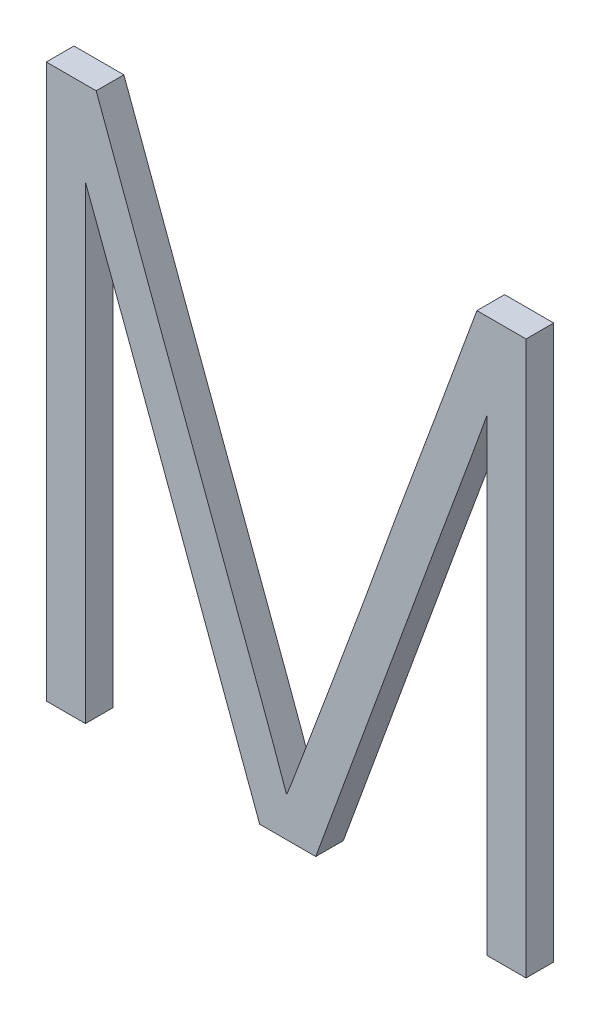
ISO-10303-21;
HEADER;
FILE_DESCRIPTION(('STEP AP214'),'2;1');
FILE_NAME('part.step','',(''),(''),'','','');
FILE_SCHEMA(('AUTOMOTIVE_DESIGN { 1 0 10303 214 1 1 1 1 }'));
ENDSEC;
DATA;
#1=APPLICATION_CONTEXT('core data for automotive mechanical design processes');
#2=APPLICATION_PROTOCOL_DEFINITION('international standard','automotive_design',2000,#1);
#3=PRODUCT_CONTEXT('',#1,'mechanical');
#4=PRODUCT('Part','Part','',(#3));
#5=PRODUCT_RELATED_PRODUCT_CATEGORY('part','',(#4));
#6=PRODUCT_DEFINITION_FORMATION('','',#4);
#7=PRODUCT_DEFINITION_CONTEXT('part definition',#1,'design');
#8=PRODUCT_DEFINITION('design','',#6,#7);
#9=PRODUCT_DEFINITION_SHAPE('','',#8);
#10=(LENGTH_UNIT() NAMED_UNIT(*) SI_UNIT(.MILLI.,.METRE.));
#11=(NAMED_UNIT(*) PLANE_ANGLE_UNIT() SI_UNIT($,.RADIAN.));
#12=(NAMED_UNIT(*) SI_UNIT($,.STERADIAN.) SOLID_ANGLE_UNIT());
#13=UNCERTAINTY_MEASURE_WITH_UNIT(LENGTH_MEASURE(1.E-05),#10,'distance_accuracy_value','');
#14=(GEOMETRIC_REPRESENTATION_CONTEXT(3) GLOBAL_UNCERTAINTY_ASSIGNED_CONTEXT((#13)) GLOBAL_UNIT_ASSIGNED_CONTEXT((#10,
#11,#12)) REPRESENTATION_CONTEXT('',''));
#15=CARTESIAN_POINT('',(0.,0.,0.));
#16=DIRECTION('',(0.,0.,1.));
#17=DIRECTION('',(1.,0.,0.));
#18=AXIS2_PLACEMENT_3D('',#15,#16,#17);
#19=CARTESIAN_POINT('',(145.47794305643,59.1271152161214,-39.1));
#20=DIRECTION('',(0.,0.,-1.));
#21=DIRECTION('',(-1.,0.,0.));
#22=AXIS2_PLACEMENT_3D('',#19,#20,#21);
#23=PLANE('',#22);
#24=DIRECTION('',(0.,1.,0.));
#25=VECTOR('',#24,1.);
#26=CARTESIAN_POINT('',(145.16175148012,58.2791772221511,-39.1));
#27=LINE('',#26,#25);
#28=CARTESIAN_POINT('',(145.16175148012,59.9740454607111,-39.1));
#29=VERTEX_POINT('',#28);
#30=CARTESIAN_POINT('',(145.16175148012,58.2791772221511,-39.1));
#31=VERTEX_POINT('',#30);
#32=EDGE_CURVE('E160',#29,#31,#27,.F.);
#33=ORIENTED_EDGE('',*,*,#32,.T.);
#34=DIRECTION('',(1.,0.,0.));
#35=VECTOR('',#34,1.);
#36=CARTESIAN_POINT('',(145.02028129982,58.2791772221511,-39.1));
#37=LINE('',#36,#35);
#38=CARTESIAN_POINT('',(145.02028129982,58.2791772221511,-39.1));
#39=VERTEX_POINT('',#38);
#40=EDGE_CURVE('E147',#31,#39,#37,.F.);
#41=ORIENTED_EDGE('',*,*,#40,.T.);
#42=DIRECTION('',(0.,1.,0.));
#43=VECTOR('',#42,1.);
#44=CARTESIAN_POINT('',(145.02028129982,60.2791772221511,-39.1));
#45=LINE('',#44,#43);
#46=CARTESIAN_POINT('',(145.02028129982,60.2791772221511,-39.1));
#47=VERTEX_POINT('',#46);
#48=EDGE_CURVE('E155',#39,#47,#45,.T.);
#49=ORIENTED_EDGE('',*,*,#48,.T.);
#50=DIRECTION('',(1.,0.,0.));
#51=VECTOR('',#50,1.);
#52=CARTESIAN_POINT('',(145.20058643158,60.2791772221511,-39.1));
#53=LINE('',#52,#51);
#54=CARTESIAN_POINT('',(145.20058643158,60.2791772221511,-39.1));
#55=VERTEX_POINT('',#54);
#56=EDGE_CURVE('E119',#47,#55,#53,.T.);
#57=ORIENTED_EDGE('',*,*,#56,.T.);
#58=CARTESIAN_POINT('',(145.20058643158,60.2791772221511,-39.1));
#59=CARTESIAN_POINT('',(145.212108784011,60.2478986421216,-39.1));
#60=CARTESIAN_POINT('',(145.223621236447,60.2166164192169,-39.1));
#61=CARTESIAN_POINT('',(145.246640800367,60.1540500978524,-39.1));
#62=CARTESIAN_POINT('',(145.258147911865,60.1227659993975,-39.1));
#63=CARTESIAN_POINT('',(145.29268328221,60.0289180307755,-39.1));
#64=CARTESIAN_POINT('',(145.315725305961,59.9663592249612,-39.1));
#65=CARTESIAN_POINT('',(145.361953650289,59.8412950573853,-39.1));
#66=CARTESIAN_POINT('',(145.385139970327,59.7787896954255,-39.1));
#67=CARTESIAN_POINT('',(145.420126677086,59.6851088831982,-39.1));
#68=CARTESIAN_POINT('',(145.431823472487,59.6538947593713,-39.1));
#69=CARTESIAN_POINT('',(145.455271280344,59.5914868424778,-39.1));
#70=CARTESIAN_POINT('',(145.467022292913,59.5602930494539,-39.1));
#71=CARTESIAN_POINT('',(145.490509129228,59.4978996863374,-39.1));
#72=CARTESIAN_POINT('',(145.502244952961,59.4667001162405,-39.1));
#73=CARTESIAN_POINT('',(145.525614807147,59.404262892076,-39.1));
#74=CARTESIAN_POINT('',(145.537248837735,59.3730252380595,-39.1));
#75=CARTESIAN_POINT('',(145.56308443564,59.3034254507554,-39.1));
#76=CARTESIAN_POINT('',(145.577268858341,59.26505696809,-39.1));
#77=CARTESIAN_POINT('',(145.605665893052,59.1883303855932,-39.1));
#78=CARTESIAN_POINT('',(145.619878505095,59.1499722857745,-39.1));
#79=CARTESIAN_POINT('',(145.648275058434,59.0732453668605,-39.1));
#80=CARTESIAN_POINT('',(145.662458999653,59.0348765477369,-39.1));
#81=CARTESIAN_POINT('',(145.690869234059,58.9581545227632,-39.1));
#82=CARTESIAN_POINT('',(145.705095527271,58.9198013169221,-39.1));
#83=CARTESIAN_POINT('',(145.733646068603,58.8431301485384,-39.1));
#84=CARTESIAN_POINT('',(145.747970319556,58.804812187052,-39.1));
#85=CARTESIAN_POINT('',(145.77664425807,58.7281861458037,-39.1));
#86=CARTESIAN_POINT('',(145.790993945375,58.6898780659466,-39.1));
#87=CARTESIAN_POINT('',(145.819416610896,58.6131597435274,-39.1));
#88=CARTESIAN_POINT('',(145.833489594617,58.574749503015,-39.1));
#89=CARTESIAN_POINT('',(145.861285806427,58.4978003305483,-39.1));
#90=CARTESIAN_POINT('',(145.875009014565,58.4592613913942,-39.1));
#91=CARTESIAN_POINT('',(145.88851985737,58.4206474024611,-39.1));
#92=B_SPLINE_CURVE_WITH_KNOTS('',3,(#58,#59,#60,#61,#62,#63,#64,#65,#66,#67,#68,#69,#70,#71,#72,
#73,#74,#75,#76,#77,#78,#79,#80,#81,#82,#83,#84,#85,#86,#87,#88,#89,#90,#91),.UNSPECIFIED.,.F.,
.F.,(4,2,2,2,2,2,2,2,2,2,2,2,2,2,2,2,4),(0.,0.100000132148041,0.200000010995544,
0.40000212608673,0.600003495926419,0.700004554241818,0.800005821505978,0.900007163784182,
1.00000837214138,1.12272772763138,1.24544723346857,1.3681670654854,1.49088696916745,
1.61361043805197,1.73633267599928,1.85905247001074,1.98177924830364),.UNSPECIFIED.);
#93=CARTESIAN_POINT('',(145.88851985737,58.4206474024611,-39.1));
#94=VERTEX_POINT('',#93);
#95=EDGE_CURVE('E24',#55,#94,#92,.T.);
#96=ORIENTED_EDGE('',*,*,#95,.T.);
#97=CARTESIAN_POINT('',(145.88851985737,58.4206474024611,-39.1));
#98=CARTESIAN_POINT('',(145.892005966057,58.4282427669072,-39.1));
#99=CARTESIAN_POINT('',(145.895287483858,58.435924283537,-39.1));
#100=CARTESIAN_POINT('',(145.901611170136,58.451383781857,-39.1));
#101=CARTESIAN_POINT('',(145.904653404004,58.4591617365153,-39.1));
#102=CARTESIAN_POINT('',(145.910669656238,58.4747414217814,-39.1));
#103=CARTESIAN_POINT('',(145.913643684146,58.4825431488887,-39.1));
#104=CARTESIAN_POINT('',(145.919579601652,58.4981521104086,-39.1));
#105=CARTESIAN_POINT('',(145.922541490395,58.5059593451652,-39.1));
#106=CARTESIAN_POINT('',(145.931397477445,58.5293899416616,-39.1));
#107=CARTESIAN_POINT('',(145.937262647401,58.5450241528653,-39.1));
#108=CARTESIAN_POINT('',(145.948981089596,58.5762977611131,-39.1));
#109=CARTESIAN_POINT('',(145.954834361346,58.591937158341,-39.1));
#110=CARTESIAN_POINT('',(145.984080180958,58.6700072696147,-39.1));
#111=CARTESIAN_POINT('',(146.007543449179,58.732411496612,-39.1));
#112=CARTESIAN_POINT('',(146.054253123724,58.8573000961496,-39.1));
#113=CARTESIAN_POINT('',(146.077499533137,58.9197844675337,-39.1));
#114=CARTESIAN_POINT('',(146.112253718067,59.0135536994878,-39.1));
#115=CARTESIAN_POINT('',(146.123819192559,59.0448171801537,-39.1));
#116=CARTESIAN_POINT('',(146.146853239766,59.1073794376968,-39.1));
#117=CARTESIAN_POINT('',(146.158321813478,59.1386782142075,-39.1));
#118=CARTESIAN_POINT('',(146.181159532688,59.2013127322042,-39.1));
#119=CARTESIAN_POINT('',(146.192528676828,59.2326484741889,-39.1));
#120=CARTESIAN_POINT('',(146.215025381519,59.2954067966694,-39.1));
#121=CARTESIAN_POINT('',(146.226152939948,59.326829377926,-39.1));
#122=CARTESIAN_POINT('',(146.244281048903,59.3774634598058,-39.1));
#123=CARTESIAN_POINT('',(146.251213902499,59.3966991479426,-39.1));
#124=CARTESIAN_POINT('',(146.265190978716,59.4351298867027,-39.1));
#125=CARTESIAN_POINT('',(146.272235200677,59.4543249375655,-39.1));
#126=CARTESIAN_POINT('',(146.293470883179,59.511871879758,-39.1));
#127=CARTESIAN_POINT('',(146.307765373779,59.5501855979383,-39.1));
#128=CARTESIAN_POINT('',(146.336355290812,59.6268126305448,-39.1));
#129=CARTESIAN_POINT('',(146.350650717247,59.6651259449709,-39.1));
#130=CARTESIAN_POINT('',(146.379094987073,59.7418069159906,-39.1));
#131=CARTESIAN_POINT('',(146.393243830805,59.7801745724575,-39.1));
#132=CARTESIAN_POINT('',(146.421473132861,59.8569313731927,-39.1));
#133=CARTESIAN_POINT('',(146.435553596694,59.895320515442,-39.1));
#134=CARTESIAN_POINT('',(146.463684797401,59.9721098378535,-39.1));
#135=CARTESIAN_POINT('',(146.477735534176,60.0105100180519,-39.1));
#136=CARTESIAN_POINT('',(146.50585586878,60.0873033538797,-39.1));
#137=CARTESIAN_POINT('',(146.51992546655,60.1256965095304,-39.1));
#138=CARTESIAN_POINT('',(146.548129376476,60.202458966067,-39.1));
#139=CARTESIAN_POINT('',(146.562263688537,60.2408282669874,-39.1));
#140=CARTESIAN_POINT('',(146.57645328317,60.2791772221511,-39.1));
#141=B_SPLINE_CURVE_WITH_KNOTS('',3,(#97,#98,#99,#100,#101,#102,#103,#104,#105,#106,#107,#108,
#109,#110,#111,#112,#113,#114,#115,#116,#117,#118,#119,#120,#121,#122,#123,#124,#125,#126,#127,
#128,#129,#130,#131,#132,#133,#134,#135,#136,#137,#138,#139,#140),.UNSPECIFIED.,.F.,.F.,(4,2,2,
2,2,2,2,2,2,2,2,2,2,2,2,2,2,2,2,2,2,4),(0.,0.0250590660102511,0.0501112599713028,
0.0751599279093421,0.10021033125765,0.150304849192142,0.200401387925977,0.400409486535909,
0.600414731514771,0.700417082523595,0.800418404043745,0.90042109034332,1.00042465547571,
1.06176509560859,1.12310517322745,1.24578520967643,1.36846532435791,1.49114515345069,
1.61381492734226,1.73648510851116,1.85915491429517,1.98182454294239),.UNSPECIFIED.);
#142=CARTESIAN_POINT('',(146.57645328317,60.2791772221511,-39.1));
#143=VERTEX_POINT('',#142);
#144=EDGE_CURVE('E122',#94,#143,#141,.T.);
#145=ORIENTED_EDGE('',*,*,#144,.T.);
#146=DIRECTION('',(1.,0.,0.));
#147=VECTOR('',#146,1.);
#148=CARTESIAN_POINT('',(146.75398448983,60.2791772221511,-39.1));
#149=LINE('',#148,#147);
#150=CARTESIAN_POINT('',(146.75398448983,60.2791772221511,-39.1));
#151=VERTEX_POINT('',#150);
#152=EDGE_CURVE('E189',#143,#151,#149,.T.);
#153=ORIENTED_EDGE('',*,*,#152,.T.);
#154=DIRECTION('',(0.,1.,0.));
#155=VECTOR('',#154,1.);
#156=CARTESIAN_POINT('',(146.75398448983,58.2791772221511,-39.1));
#157=LINE('',#156,#155);
#158=CARTESIAN_POINT('',(146.75398448983,58.2791772221511,-39.1));
#159=VERTEX_POINT('',#158);
#160=EDGE_CURVE('E184',#151,#159,#157,.F.);
#161=ORIENTED_EDGE('',*,*,#160,.T.);
#162=DIRECTION('',(1.,0.,0.));
#163=VECTOR('',#162,1.);
#164=CARTESIAN_POINT('',(146.61251430952,58.2791772221511,-39.1));
#165=LINE('',#164,#163);
#166=CARTESIAN_POINT('',(146.61251430952,58.2791772221511,-39.1));
#167=VERTEX_POINT('',#166);
#168=EDGE_CURVE('E179',#159,#167,#165,.F.);
#169=ORIENTED_EDGE('',*,*,#168,.T.);
#170=DIRECTION('',(0.,1.,0.));
#171=VECTOR('',#170,1.);
#172=CARTESIAN_POINT('',(146.61251430952,59.9684976105011,-39.1));
#173=LINE('',#172,#171);
#174=CARTESIAN_POINT('',(146.61251430952,59.9684976105011,-39.1));
#175=VERTEX_POINT('',#174);
#176=EDGE_CURVE('E173',#167,#175,#173,.T.);
#177=ORIENTED_EDGE('',*,*,#176,.T.);
#178=CARTESIAN_POINT('',(146.61251430952,59.9684976105011,-39.1));
#179=CARTESIAN_POINT('',(146.601523782024,59.93702378012,-39.1));
#180=CARTESIAN_POINT('',(146.590294723462,59.9056357559547,-39.1));
#181=CARTESIAN_POINT('',(146.567564105003,59.8429589204688,-39.1));
#182=CARTESIAN_POINT('',(146.556062550653,59.8116701071435,-39.1));
#183=CARTESIAN_POINT('',(146.521456841954,59.7178462069297,-39.1));
#184=CARTESIAN_POINT('',(146.498250099856,59.6553494217342,-39.1));
#185=CARTESIAN_POINT('',(146.463410992311,59.5616144672175,-39.1));
#186=CARTESIAN_POINT('',(146.451793067245,59.530371033677,-39.1));
#187=CARTESIAN_POINT('',(146.428664256672,59.4678446117258,-39.1));
#188=CARTESIAN_POINT('',(146.417153370813,59.4365616234455,-39.1));
#189=CARTESIAN_POINT('',(146.394256721645,59.3739500463529,-39.1));
#190=CARTESIAN_POINT('',(146.382870957983,59.3426214576694,-39.1));
#191=CARTESIAN_POINT('',(146.360119025565,59.2799572423942,-39.1));
#192=CARTESIAN_POINT('',(146.348752856814,59.2486216158002,-39.1));
#193=CARTESIAN_POINT('',(146.3259563641,59.1859734217152,-39.1));
#194=CARTESIAN_POINT('',(146.314526039999,59.1546608542738,-39.1));
#195=CARTESIAN_POINT('',(146.291468614376,59.0921082326374,-39.1));
#196=CARTESIAN_POINT('',(146.279841512253,59.0608681786642,-39.1));
#197=CARTESIAN_POINT('',(146.256706022333,58.9983882827203,-39.1));
#198=CARTESIAN_POINT('',(146.245197504858,58.9671484888228,-39.1));
#199=CARTESIAN_POINT('',(146.222341373042,58.9046101482315,-39.1));
#200=CARTESIAN_POINT('',(146.21099375872,58.8733116015304,-39.1));
#201=CARTESIAN_POINT('',(146.188302334511,58.8107132926145,-39.1));
#202=CARTESIAN_POINT('',(146.176958524615,58.7794135304029,-39.1));
#203=CARTESIAN_POINT('',(146.154202898051,58.7168387391951,-39.1));
#204=CARTESIAN_POINT('',(146.142791081455,58.6855637101727,-39.1));
#205=CARTESIAN_POINT('',(146.119930236319,58.6230275540929,-39.1));
#206=CARTESIAN_POINT('',(146.108481208065,58.5917664269312,-39.1));
#207=CARTESIAN_POINT('',(146.085564192144,58.5292510725885,-39.1));
#208=CARTESIAN_POINT('',(146.07409620445,58.4979968454174,-39.1));
#209=CARTESIAN_POINT('',(146.051162898495,58.435487355994,-39.1));
#210=CARTESIAN_POINT('',(146.039697580238,58.4042320937401,-39.1));
#211=CARTESIAN_POINT('',(146.016790459184,58.3417129997889,-39.1));
#212=CARTESIAN_POINT('',(146.005348656357,58.3104491681021,-39.1));
#213=CARTESIAN_POINT('',(145.99392901133,58.2791772221511,-39.1));
#214=B_SPLINE_CURVE_WITH_KNOTS('',3,(#178,#179,#180,#181,#182,#183,#184,#185,#186,#187,#188,
#189,#190,#191,#192,#193,#194,#195,#196,#197,#198,#199,#200,#201,#202,#203,#204,#205,#206,#207,
#208,#209,#210,#211,#212,#213),.UNSPECIFIED.,.F.,.F.,(4,2,2,2,2,2,2,2,2,2,2,2,2,2,2,2,2,4),(0.,
0.100008521082201,0.200015008349473,0.400014453570882,0.500015153076334,0.600015523542117,
0.700015611892835,0.800015731149181,0.900016065252841,1.00001670489358,1.09989295408789,
1.19976921553884,1.29964523002893,1.39952113858691,1.49939628368808,1.59927156974842,
1.69914700824413,1.79902232361528),.UNSPECIFIED.);
#215=CARTESIAN_POINT('',(145.99392901133,58.2791772221511,-39.1));
#216=VERTEX_POINT('',#215);
#217=EDGE_CURVE('E255',#175,#216,#214,.T.);
#218=ORIENTED_EDGE('',*,*,#217,.T.);
#219=DIRECTION('',(1.,0.,0.));
#220=VECTOR('',#219,1.);
#221=CARTESIAN_POINT('',(145.79143247873,58.2791772221511,-39.1));
#222=LINE('',#221,#220);
#223=CARTESIAN_POINT('',(145.79143247873,58.2791772221511,-39.1));
#224=VERTEX_POINT('',#223);
#225=EDGE_CURVE('E169',#216,#224,#222,.F.);
#226=ORIENTED_EDGE('',*,*,#225,.T.);
#227=CARTESIAN_POINT('',(145.79143247873,58.2791772221511,-39.1));
#228=CARTESIAN_POINT('',(145.779861963012,58.3104379961659,-39.1));
#229=CARTESIAN_POINT('',(145.768307669649,58.3417047614242,-39.1));
#230=CARTESIAN_POINT('',(145.745215308321,58.4042442640925,-39.1));
#231=CARTESIAN_POINT('',(145.733677240345,58.435517001499,-39.1));
#232=CARTESIAN_POINT('',(145.69906300046,58.5293352786431,-39.1));
#233=CARTESIAN_POINT('',(145.67598681763,58.5918808154409,-39.1));
#234=CARTESIAN_POINT('',(145.641282801235,58.6856660034924,-39.1));
#235=CARTESIAN_POINT('',(145.629699834757,58.7169222240362,-39.1));
#236=CARTESIAN_POINT('',(145.606480177993,58.7794146506151,-39.1));
#237=CARTESIAN_POINT('',(145.594843487715,58.8106508566529,-39.1));
#238=CARTESIAN_POINT('',(145.565630970486,58.8890551095284,-39.1));
#239=CARTESIAN_POINT('',(145.548053360165,58.9362225869631,-39.1));
#240=CARTESIAN_POINT('',(145.513235551428,59.0306819818046,-39.1));
#241=CARTESIAN_POINT('',(145.495995353365,59.0779738993419,-39.1));
#242=CARTESIAN_POINT('',(145.461282431767,59.1724719626939,-39.1));
#243=CARTESIAN_POINT('',(145.443809709096,59.2196781088271,-39.1));
#244=CARTESIAN_POINT('',(145.408798011794,59.3140657273023,-39.1));
#245=CARTESIAN_POINT('',(145.391259037149,59.3612471996397,-39.1));
#246=CARTESIAN_POINT('',(145.356180844656,59.455609822928,-39.1));
#247=CARTESIAN_POINT('',(145.338641626809,59.5027909738793,-39.1));
#248=CARTESIAN_POINT('',(145.303508421673,59.5971329962509,-39.1));
#249=CARTESIAN_POINT('',(145.285914434414,59.6442938676825,-39.1));
#250=CARTESIAN_POINT('',(145.259321792355,59.7149597387545,-39.1));
#251=CARTESIAN_POINT('',(145.250423919067,59.7385025846145,-39.1));
#252=CARTESIAN_POINT('',(145.232561394668,59.7855628758212,-39.1));
#253=CARTESIAN_POINT('',(145.223596743466,59.8090803211329,-39.1));
#254=CARTESIAN_POINT('',(145.205712174841,59.8561324293182,-39.1));
#255=CARTESIAN_POINT('',(145.196792257443,59.8796670922011,-39.1));
#256=CARTESIAN_POINT('',(145.179117708984,59.9267985690331,-39.1));
#257=CARTESIAN_POINT('',(145.170363079943,59.9503953837382,-39.1));
#258=CARTESIAN_POINT('',(145.16175148012,59.9740454607111,-39.1));
#259=B_SPLINE_CURVE_WITH_KNOTS('',3,(#227,#228,#229,#230,#231,#232,#233,#234,#235,#236,#237,
#238,#239,#240,#241,#242,#243,#244,#245,#246,#247,#248,#249,#250,#251,#252,#253,#254,#255,#256,
#257,#258),.UNSPECIFIED.,.F.,.F.,(4,2,2,2,2,2,2,2,2,2,2,2,2,2,2,4),(0.,0.100000055928653,
0.200000053940894,0.400000266974288,0.500000442105679,0.600000604038035,0.751008826562104,
0.902017207485425,1.05302502654709,1.20403287379755,1.35504010848323,1.50604725753468,
1.58155165556998,1.65705615742987,1.73256070053887,1.80806616643373),.UNSPECIFIED.);
#260=EDGE_CURVE('E267',#224,#29,#259,.T.);
#261=ORIENTED_EDGE('',*,*,#260,.T.);
#262=EDGE_LOOP('',(#33,#41,#49,#57,#96,#145,#153,#161,#169,#177,#218,#226,#261));
#263=FACE_BOUND('',#262,.T.);
#264=ADVANCED_FACE('F17',(#263),#23,.T.);
#265=CARTESIAN_POINT('',(145.20058643158,60.2791772221511,-39.));
#266=DIRECTION('',(0.,-1.,0.));
#267=DIRECTION('',(0.,0.,-1.));
#268=AXIS2_PLACEMENT_3D('',#265,#266,#267);
#269=PLANE('',#268);
#270=DIRECTION('',(0.,0.,-1.));
#271=VECTOR('',#270,1.);
#272=CARTESIAN_POINT('',(145.02028129982,60.2791772221511,-39.));
#273=LINE('',#272,#271);
#274=CARTESIAN_POINT('',(145.02028129982,60.2791772221511,-39.));
#275=VERTEX_POINT('',#274);
#276=EDGE_CURVE('E144',#47,#275,#273,.F.);
#277=ORIENTED_EDGE('',*,*,#276,.T.);
#278=DIRECTION('',(-1.,0.,0.));
#279=VECTOR('',#278,1.);
#280=CARTESIAN_POINT('',(145.47794305643,60.2791772221511,-39.));
#281=LINE('',#280,#279);
#282=CARTESIAN_POINT('',(145.20058643158,60.2791772221511,-39.));
#283=VERTEX_POINT('',#282);
#284=EDGE_CURVE('E157',#275,#283,#281,.F.);
#285=ORIENTED_EDGE('',*,*,#284,.T.);
#286=DIRECTION('',(0.,0.,-1.));
#287=VECTOR('',#286,1.);
#288=CARTESIAN_POINT('',(145.20058643158,60.2791772221511,-39.05));
#289=LINE('',#288,#287);
#290=EDGE_CURVE('E128',#283,#55,#289,.T.);
#291=ORIENTED_EDGE('',*,*,#290,.T.);
#292=ORIENTED_EDGE('',*,*,#56,.F.);
#293=EDGE_LOOP('',(#277,#285,#291,#292));
#294=FACE_BOUND('',#293,.T.);
#295=ADVANCED_FACE('F263',(#294),#269,.F.);
#296=CARTESIAN_POINT('',(145.88851985737,58.4206474024611,-39.));
#297=CARTESIAN_POINT('',(145.88851985737,58.4206474024611,-39.1));
#298=CARTESIAN_POINT('',(145.88633791079,58.4270265905111,-39.));
#299=CARTESIAN_POINT('',(145.88633791079,58.4270265905111,-39.1));
#300=CARTESIAN_POINT('',(145.88004677936,58.4451360852511,-39.));
#301=CARTESIAN_POINT('',(145.88004677936,58.4451360852511,-39.1));
#302=CARTESIAN_POINT('',(145.86749783769,58.4802495847111,-39.));
#303=CARTESIAN_POINT('',(145.86749783769,58.4802495847111,-39.1));
#304=CARTESIAN_POINT('',(145.84955255517,58.5304163487711,-39.));
#305=CARTESIAN_POINT('',(145.84955255517,58.5304163487711,-39.1));
#306=CARTESIAN_POINT('',(145.82664415031,58.5935178549611,-39.));
#307=CARTESIAN_POINT('',(145.82664415031,58.5935178549611,-39.1));
#308=CARTESIAN_POINT('',(145.79934615458,58.6674823058711,-39.));
#309=CARTESIAN_POINT('',(145.79934615458,58.6674823058711,-39.1));
#310=CARTESIAN_POINT('',(145.76818772783,58.7508053700611,-39.));
#311=CARTESIAN_POINT('',(145.76818772783,58.7508053700611,-39.1));
#312=CARTESIAN_POINT('',(145.73381099793,58.8426106718611,-39.));
#313=CARTESIAN_POINT('',(145.73381099793,58.8426106718611,-39.1));
#314=CARTESIAN_POINT('',(145.69684080441,58.9420155975811,-39.));
#315=CARTESIAN_POINT('',(145.69684080441,58.9420155975811,-39.1));
#316=CARTESIAN_POINT('',(145.65774432428,59.0475961944711,-39.));
#317=CARTESIAN_POINT('',(145.65774432428,59.0475961944711,-39.1));
#318=CARTESIAN_POINT('',(145.61711633667,59.1574952925811,-39.));
#319=CARTESIAN_POINT('',(145.61711633667,59.1574952925811,-39.1));
#320=CARTESIAN_POINT('',(145.57547420434,59.2698268679911,-39.));
#321=CARTESIAN_POINT('',(145.57547420434,59.2698268679911,-39.1));
#322=CARTESIAN_POINT('',(145.51352803317,59.4373805569711,-39.));
#323=CARTESIAN_POINT('',(145.51352803317,59.4373805569711,-39.1));
#324=CARTESIAN_POINT('',(145.42674725996,59.6663977032211,-39.));
#325=CARTESIAN_POINT('',(145.42674725996,59.6663977032211,-39.1));
#326=CARTESIAN_POINT('',(145.31601803699,59.9651437818911,-39.));
#327=CARTESIAN_POINT('',(145.31601803699,59.9651437818911,-39.1));
#328=CARTESIAN_POINT('',(145.24005682157,60.1720296924811,-39.));
#329=CARTESIAN_POINT('',(145.24005682157,60.1720296924811,-39.1));
#330=CARTESIAN_POINT('',(145.20058643158,60.2791772221511,-39.));
#331=CARTESIAN_POINT('',(145.20058643158,60.2791772221511,-39.1));
#332=B_SPLINE_SURFACE_WITH_KNOTS('',3,1,((#296,#297),(#298,#299),(#300,#301),(#302,#303),(#304,
#305),(#306,#307),(#308,#309),(#310,#311),(#312,#313),(#314,#315),(#316,#317),(#318,#319),(#320,
#321),(#322,#323),(#324,#325),(#326,#327),(#328,#329),(#330,#331)),.UNSPECIFIED.,.F.,.F.,.F.,(4,
1,1,1,1,1,1,1,1,1,1,1,1,1,1,4),(2,2),(0.,0.0102057842758,0.0290211070983,0.0564463684031,
0.090860460605,0.1306430174351,0.1757948239021,0.2255245665059,0.2790406198628,0.3363431082692,
0.3959574695856,0.4564090693549,0.5176979153008,0.6663774156369,0.8271442366999,1.),(1.,1.1),.UNSPECIFIED.);
#333=CARTESIAN_POINT('',(145.20058643158,60.2791772221511,-39.));
#334=CARTESIAN_POINT('',(145.212108784011,60.2478986421216,-39.));
#335=CARTESIAN_POINT('',(145.223621236447,60.2166164192169,-39.));
#336=CARTESIAN_POINT('',(145.246640800367,60.1540500978524,-39.));
#337=CARTESIAN_POINT('',(145.258147911865,60.1227659993975,-39.));
#338=CARTESIAN_POINT('',(145.29268328221,60.0289180307755,-39.));
#339=CARTESIAN_POINT('',(145.315725305961,59.9663592249612,-39.));
#340=CARTESIAN_POINT('',(145.361953650289,59.8412950573853,-39.));
#341=CARTESIAN_POINT('',(145.385139970327,59.7787896954255,-39.));
#342=CARTESIAN_POINT('',(145.420126677086,59.6851088831982,-39.));
#343=CARTESIAN_POINT('',(145.431823472487,59.6538947593712,-39.));
#344=CARTESIAN_POINT('',(145.455271280344,59.5914868424778,-39.));
#345=CARTESIAN_POINT('',(145.467022292913,59.5602930494539,-39.));
#346=CARTESIAN_POINT('',(145.490509129228,59.4978996863374,-39.));
#347=CARTESIAN_POINT('',(145.502244952961,59.4667001162405,-39.));
#348=CARTESIAN_POINT('',(145.525614807147,59.404262892076,-39.));
#349=CARTESIAN_POINT('',(145.537248837735,59.3730252380595,-39.));
#350=CARTESIAN_POINT('',(145.56308443564,59.3034254507554,-39.));
#351=CARTESIAN_POINT('',(145.577268858341,59.26505696809,-39.));
#352=CARTESIAN_POINT('',(145.605665893052,59.1883303855932,-39.));
#353=CARTESIAN_POINT('',(145.619878505095,59.1499722857745,-39.));
#354=CARTESIAN_POINT('',(145.648275058434,59.0732453668605,-39.));
#355=CARTESIAN_POINT('',(145.662458999653,59.0348765477369,-39.));
#356=CARTESIAN_POINT('',(145.690869234059,58.9581545227632,-39.));
#357=CARTESIAN_POINT('',(145.705095527271,58.9198013169221,-39.));
#358=CARTESIAN_POINT('',(145.733646068603,58.8431301485384,-39.));
#359=CARTESIAN_POINT('',(145.747970319556,58.804812187052,-39.));
#360=CARTESIAN_POINT('',(145.77664425807,58.7281861458037,-39.));
#361=CARTESIAN_POINT('',(145.790993945375,58.6898780659466,-39.));
#362=CARTESIAN_POINT('',(145.819416610896,58.6131597435274,-39.));
#363=CARTESIAN_POINT('',(145.833489594617,58.574749503015,-39.));
#364=CARTESIAN_POINT('',(145.861285806427,58.4978003305483,-39.));
#365=CARTESIAN_POINT('',(145.875009014565,58.4592613913942,-39.));
#366=CARTESIAN_POINT('',(145.88851985737,58.4206474024611,-39.));
#367=B_SPLINE_CURVE_WITH_KNOTS('',3,(#333,#334,#335,#336,#337,#338,#339,#340,#341,#342,#343,
#344,#345,#346,#347,#348,#349,#350,#351,#352,#353,#354,#355,#356,#357,#358,#359,#360,#361,#362,
#363,#364,#365,#366),.UNSPECIFIED.,.F.,.F.,(4,2,2,2,2,2,2,2,2,2,2,2,2,2,2,2,4),(0.,
0.100000132148041,0.200000010995544,0.400002126086736,0.600003495926416,0.700004554241815,
0.800005821505985,0.900007163784182,1.00000837214138,1.12272772763135,1.24544723346857,
1.3681670654854,1.49088696916745,1.61361043805197,1.73633267599928,1.85905247001074,
1.98177924830364),.UNSPECIFIED.);
#368=CARTESIAN_POINT('',(145.88851985737,58.4206474024611,-39.));
#369=VERTEX_POINT('',#368);
#370=EDGE_CURVE('E138',#283,#369,#367,.T.);
#371=DIRECTION('',(0.,0.,-1.));
#372=VECTOR('',#371,1.);
#373=CARTESIAN_POINT('',(145.88851985737,58.4206474024611,-39.05));
#374=LINE('',#373,#372);
#375=EDGE_CURVE('E127',#369,#94,#374,.T.);
#376=ORIENTED_EDGE('',*,*,#290,.F.);
#377=ORIENTED_EDGE('',*,*,#370,.T.);
#378=ORIENTED_EDGE('',*,*,#375,.T.);
#379=ORIENTED_EDGE('',*,*,#95,.F.);
#380=EDGE_LOOP('',(#376,#377,#378,#379));
#381=FACE_BOUND('',#380,.T.);
#382=ADVANCED_FACE('F136',(#381),#332,.F.);
#383=CARTESIAN_POINT('',(146.57645328317,60.2791772221511,-39.));
#384=CARTESIAN_POINT('',(146.57645328317,60.2791772221511,-39.1));
#385=CARTESIAN_POINT('',(146.53683945993,60.1721177969811,-39.));
#386=CARTESIAN_POINT('',(146.53683945993,60.1721177969811,-39.1));
#387=CARTESIAN_POINT('',(146.46124400071,59.9652518769011,-39.));
#388=CARTESIAN_POINT('',(146.46124400071,59.9652518769011,-39.1));
#389=CARTESIAN_POINT('',(146.35161656409,59.6664450972311,-39.));
#390=CARTESIAN_POINT('',(146.35161656409,59.6664450972311,-39.1));
#391=CARTESIAN_POINT('',(146.26535472592,59.4377136445311,-39.));
#392=CARTESIAN_POINT('',(146.26535472592,59.4377136445311,-39.1));
#393=CARTESIAN_POINT('',(146.20599782638,59.2697107666111,-39.));
#394=CARTESIAN_POINT('',(146.20599782638,59.2697107666111,-39.1));
#395=CARTESIAN_POINT('',(146.16522199672,59.1573985707911,-39.));
#396=CARTESIAN_POINT('',(146.16522199672,59.1573985707911,-39.1));
#397=CARTESIAN_POINT('',(146.12487849126,59.0475453082711,-39.));
#398=CARTESIAN_POINT('',(146.12487849126,59.0475453082711,-39.1));
#399=CARTESIAN_POINT('',(146.08573683429,58.9420192542611,-39.));
#400=CARTESIAN_POINT('',(146.08573683429,58.9420192542611,-39.1));
#401=CARTESIAN_POINT('',(146.04877315484,58.8426119591811,-39.));
#402=CARTESIAN_POINT('',(146.04877315484,58.8426119591811,-39.1));
#403=CARTESIAN_POINT('',(146.01441357125,58.7507810227011,-39.));
#404=CARTESIAN_POINT('',(146.01441357125,58.7507810227011,-39.1));
#405=CARTESIAN_POINT('',(145.98314393747,58.6674229562311,-39.));
#406=CARTESIAN_POINT('',(145.98314393747,58.6674229562311,-39.1));
#407=CARTESIAN_POINT('',(145.95538635076,58.5934590607811,-39.));
#408=CARTESIAN_POINT('',(145.95538635076,58.5934590607811,-39.1));
#409=CARTESIAN_POINT('',(145.93178570669,58.5303266838111,-39.));
#410=CARTESIAN_POINT('',(145.93178570669,58.5303266838111,-39.1));
#411=CARTESIAN_POINT('',(145.91277393648,58.4801562961511,-39.));
#412=CARTESIAN_POINT('',(145.91277393648,58.4801562961511,-39.1));
#413=CARTESIAN_POINT('',(145.89917440758,58.4448984072711,-39.));
#414=CARTESIAN_POINT('',(145.89917440758,58.4448984072711,-39.1));
#415=CARTESIAN_POINT('',(145.89141594248,58.4269659681111,-39.));
#416=CARTESIAN_POINT('',(145.89141594248,58.4269659681111,-39.1));
#417=CARTESIAN_POINT('',(145.88851985737,58.4206474024611,-39.));
#418=CARTESIAN_POINT('',(145.88851985737,58.4206474024611,-39.1));
#419=B_SPLINE_SURFACE_WITH_KNOTS('',3,1,((#383,#384),(#385,#386),(#387,#388),(#389,#390),(#391,
#392),(#393,#394),(#395,#396),(#397,#398),(#399,#400),(#401,#402),(#403,#404),(#405,#406),(#407,
#408),(#409,#410),(#411,#412),(#413,#414),(#415,#416),(#417,#418)),.UNSPECIFIED.,.F.,.F.,.F.,(4,
1,1,1,1,1,1,1,1,1,1,1,1,1,1,4),(2,2),(0.,0.1727984092634,0.3333999152557,0.4818047307791,
0.5428262969729,0.6031161524939,0.662675460308,0.7199767275052,0.7734916403479,0.82322032313,
0.8683984120715,0.90826143172568,0.94280938209269,0.97042247515627,0.98948309115598,1.),(1.,
1.1),.UNSPECIFIED.);
#420=CARTESIAN_POINT('',(145.88851985737,58.4206474024611,-39.));
#421=CARTESIAN_POINT('',(145.892005966057,58.4282427669072,-39.));
#422=CARTESIAN_POINT('',(145.895287483858,58.435924283537,-39.));
#423=CARTESIAN_POINT('',(145.901611170136,58.4513837818569,-39.));
#424=CARTESIAN_POINT('',(145.904653404004,58.4591617365153,-39.));
#425=CARTESIAN_POINT('',(145.910669656238,58.4747414217815,-39.));
#426=CARTESIAN_POINT('',(145.913643684146,58.4825431488887,-39.));
#427=CARTESIAN_POINT('',(145.919579601652,58.4981521104086,-39.));
#428=CARTESIAN_POINT('',(145.922541490395,58.5059593451652,-39.));
#429=CARTESIAN_POINT('',(145.931397477445,58.5293899416615,-39.));
#430=CARTESIAN_POINT('',(145.937262647401,58.5450241528653,-39.));
#431=CARTESIAN_POINT('',(145.948981089596,58.5762977611131,-39.));
#432=CARTESIAN_POINT('',(145.954834361346,58.591937158341,-39.));
#433=CARTESIAN_POINT('',(145.984080180958,58.6700072696147,-39.));
#434=CARTESIAN_POINT('',(146.007543449179,58.732411496612,-39.));
#435=CARTESIAN_POINT('',(146.054253123724,58.8573000961496,-39.));
#436=CARTESIAN_POINT('',(146.077499533137,58.9197844675337,-39.));
#437=CARTESIAN_POINT('',(146.112253718067,59.0135536994878,-39.));
#438=CARTESIAN_POINT('',(146.123819192559,59.0448171801537,-39.));
#439=CARTESIAN_POINT('',(146.146853239766,59.1073794376968,-39.));
#440=CARTESIAN_POINT('',(146.158321813478,59.1386782142075,-39.));
#441=CARTESIAN_POINT('',(146.181159532688,59.2013127322042,-39.));
#442=CARTESIAN_POINT('',(146.192528676828,59.2326484741889,-39.));
#443=CARTESIAN_POINT('',(146.215025381519,59.2954067966694,-39.));
#444=CARTESIAN_POINT('',(146.226152939948,59.326829377926,-39.));
#445=CARTESIAN_POINT('',(146.244281048903,59.3774634598058,-39.));
#446=CARTESIAN_POINT('',(146.251213902499,59.3966991479426,-39.));
#447=CARTESIAN_POINT('',(146.265190978716,59.4351298867027,-39.));
#448=CARTESIAN_POINT('',(146.272235200677,59.4543249375655,-39.));
#449=CARTESIAN_POINT('',(146.293470883179,59.511871879758,-39.));
#450=CARTESIAN_POINT('',(146.307765373779,59.5501855979382,-39.));
#451=CARTESIAN_POINT('',(146.336355290812,59.6268126305448,-39.));
#452=CARTESIAN_POINT('',(146.350650717247,59.6651259449709,-39.));
#453=CARTESIAN_POINT('',(146.379094987073,59.7418069159906,-39.));
#454=CARTESIAN_POINT('',(146.393243830805,59.7801745724575,-39.));
#455=CARTESIAN_POINT('',(146.421473132861,59.8569313731927,-39.));
#456=CARTESIAN_POINT('',(146.435553596694,59.8953205154421,-39.));
#457=CARTESIAN_POINT('',(146.463684797401,59.9721098378536,-39.));
#458=CARTESIAN_POINT('',(146.477735534176,60.0105100180519,-39.));
#459=CARTESIAN_POINT('',(146.50585586878,60.0873033538797,-39.));
#460=CARTESIAN_POINT('',(146.51992546655,60.1256965095304,-39.));
#461=CARTESIAN_POINT('',(146.548129376476,60.202458966067,-39.));
#462=CARTESIAN_POINT('',(146.562263688537,60.2408282669874,-39.));
#463=CARTESIAN_POINT('',(146.57645328317,60.2791772221511,-39.));
#464=B_SPLINE_CURVE_WITH_KNOTS('',3,(#420,#421,#422,#423,#424,#425,#426,#427,#428,#429,#430,
#431,#432,#433,#434,#435,#436,#437,#438,#439,#440,#441,#442,#443,#444,#445,#446,#447,#448,#449,
#450,#451,#452,#453,#454,#455,#456,#457,#458,#459,#460,#461,#462,#463),.UNSPECIFIED.,.F.,.F.,(4,
2,2,2,2,2,2,2,2,2,2,2,2,2,2,2,2,2,2,2,2,4),(0.,0.0250590660102319,0.0501112599713057,
0.0751599279093386,0.100210331257647,0.150304849192161,0.200401387925977,0.400409486535899,
0.600414731514768,0.700417082523591,0.800418404043735,0.900421090343323,1.00042465547571,
1.0617650956086,1.12310517322745,1.24578520967643,1.36846532435791,1.49114515345068,
1.61381492734226,1.73648510851116,1.85915491429517,1.98182454294239),.UNSPECIFIED.);
#465=CARTESIAN_POINT('',(146.57645328317,60.2791772221511,-39.));
#466=VERTEX_POINT('',#465);
#467=EDGE_CURVE('E220',#369,#466,#464,.T.);
#468=DIRECTION('',(0.,0.,-1.));
#469=VECTOR('',#468,1.);
#470=CARTESIAN_POINT('',(146.57645328317,60.2791772221511,-39.));
#471=LINE('',#470,#469);
#472=EDGE_CURVE('E134',#466,#143,#471,.T.);
#473=ORIENTED_EDGE('',*,*,#375,.F.);
#474=ORIENTED_EDGE('',*,*,#467,.T.);
#475=ORIENTED_EDGE('',*,*,#472,.T.);
#476=ORIENTED_EDGE('',*,*,#144,.F.);
#477=EDGE_LOOP('',(#473,#474,#475,#476));
#478=FACE_BOUND('',#477,.T.);
#479=ADVANCED_FACE('F131',(#478),#419,.F.);
#480=CARTESIAN_POINT('',(146.75398448983,60.2791772221511,-39.));
#481=DIRECTION('',(0.,-1.,0.));
#482=DIRECTION('',(0.,0.,-1.));
#483=AXIS2_PLACEMENT_3D('',#480,#481,#482);
#484=PLANE('',#483);
#485=ORIENTED_EDGE('',*,*,#472,.F.);
#486=DIRECTION('',(-1.,0.,0.));
#487=VECTOR('',#486,1.);
#488=CARTESIAN_POINT('',(145.47794305643,60.2791772221511,-39.));
#489=LINE('',#488,#487);
#490=CARTESIAN_POINT('',(146.75398448983,60.2791772221511,-39.));
#491=VERTEX_POINT('',#490);
#492=EDGE_CURVE('E226',#466,#491,#489,.F.);
#493=ORIENTED_EDGE('',*,*,#492,.T.);
#494=DIRECTION('',(0.,0.,1.));
#495=VECTOR('',#494,1.);
#496=CARTESIAN_POINT('',(146.75398448983,60.2791772221511,-39.));
#497=LINE('',#496,#495);
#498=EDGE_CURVE('E186',#491,#151,#497,.F.);
#499=ORIENTED_EDGE('',*,*,#498,.T.);
#500=ORIENTED_EDGE('',*,*,#152,.F.);
#501=EDGE_LOOP('',(#485,#493,#499,#500));
#502=FACE_BOUND('',#501,.T.);
#503=ADVANCED_FACE('F236',(#502),#484,.F.);
#504=CARTESIAN_POINT('',(146.75398448983,58.2791772221511,-39.));
#505=DIRECTION('',(-1.,0.,0.));
#506=DIRECTION('',(0.,0.,1.));
#507=AXIS2_PLACEMENT_3D('',#504,#505,#506);
#508=PLANE('',#507);
#509=ORIENTED_EDGE('',*,*,#498,.F.);
#510=DIRECTION('',(0.,1.,0.));
#511=VECTOR('',#510,1.);
#512=CARTESIAN_POINT('',(146.75398448983,59.1271152161214,-39.));
#513=LINE('',#512,#511);
#514=CARTESIAN_POINT('',(146.75398448983,58.2791772221511,-39.));
#515=VERTEX_POINT('',#514);
#516=EDGE_CURVE('E302',#491,#515,#513,.F.);
#517=ORIENTED_EDGE('',*,*,#516,.T.);
#518=DIRECTION('',(0.,0.,1.));
#519=VECTOR('',#518,1.);
#520=CARTESIAN_POINT('',(146.75398448983,58.2791772221511,-39.));
#521=LINE('',#520,#519);
#522=EDGE_CURVE('E181',#515,#159,#521,.F.);
#523=ORIENTED_EDGE('',*,*,#522,.T.);
#524=ORIENTED_EDGE('',*,*,#160,.F.);
#525=EDGE_LOOP('',(#509,#517,#523,#524));
#526=FACE_BOUND('',#525,.T.);
#527=ADVANCED_FACE('F321',(#526),#508,.F.);
#528=CARTESIAN_POINT('',(146.61251430952,58.2791772221511,-39.));
#529=DIRECTION('',(0.,1.,0.));
#530=DIRECTION('',(0.,0.,1.));
#531=AXIS2_PLACEMENT_3D('',#528,#529,#530);
#532=PLANE('',#531);
#533=ORIENTED_EDGE('',*,*,#522,.F.);
#534=DIRECTION('',(-1.,0.,0.));
#535=VECTOR('',#534,1.);
#536=CARTESIAN_POINT('',(145.47794305643,58.2791772221511,-39.));
#537=LINE('',#536,#535);
#538=CARTESIAN_POINT('',(146.61251430952,58.2791772221511,-39.));
#539=VERTEX_POINT('',#538);
#540=EDGE_CURVE('E293',#515,#539,#537,.T.);
#541=ORIENTED_EDGE('',*,*,#540,.T.);
#542=DIRECTION('',(0.,0.,-1.));
#543=VECTOR('',#542,1.);
#544=CARTESIAN_POINT('',(146.61251430952,58.2791772221511,-39.));
#545=LINE('',#544,#543);
#546=EDGE_CURVE('E176',#539,#167,#545,.T.);
#547=ORIENTED_EDGE('',*,*,#546,.T.);
#548=ORIENTED_EDGE('',*,*,#168,.F.);
#549=EDGE_LOOP('',(#533,#541,#547,#548));
#550=FACE_BOUND('',#549,.T.);
#551=ADVANCED_FACE('F327',(#550),#532,.F.);
#552=CARTESIAN_POINT('',(146.61251430952,59.9684976105011,-39.));
#553=DIRECTION('',(1.,0.,0.));
#554=DIRECTION('',(0.,0.,-1.));
#555=AXIS2_PLACEMENT_3D('',#552,#553,#554);
#556=PLANE('',#555);
#557=ORIENTED_EDGE('',*,*,#546,.F.);
#558=DIRECTION('',(0.,1.,0.));
#559=VECTOR('',#558,1.);
#560=CARTESIAN_POINT('',(146.61251430952,59.1271152161214,-39.));
#561=LINE('',#560,#559);
#562=CARTESIAN_POINT('',(146.61251430952,59.9684976105011,-39.));
#563=VERTEX_POINT('',#562);
#564=EDGE_CURVE('E290',#539,#563,#561,.T.);
#565=ORIENTED_EDGE('',*,*,#564,.T.);
#566=DIRECTION('',(0.,0.,-1.));
#567=VECTOR('',#566,1.);
#568=CARTESIAN_POINT('',(146.61251430952,59.9684976105011,-39.05));
#569=LINE('',#568,#567);
#570=EDGE_CURVE('E175',#563,#175,#569,.T.);
#571=ORIENTED_EDGE('',*,*,#570,.T.);
#572=ORIENTED_EDGE('',*,*,#176,.F.);
#573=EDGE_LOOP('',(#557,#565,#571,#572));
#574=FACE_BOUND('',#573,.T.);
#575=ADVANCED_FACE('F332',(#574),#556,.F.);
#576=CARTESIAN_POINT('',(145.99392901133,58.2791772221511,-39.));
#577=CARTESIAN_POINT('',(145.99392901133,58.2791772221511,-39.1));
#578=CARTESIAN_POINT('',(146.02455519752,58.3630453953111,-39.));
#579=CARTESIAN_POINT('',(146.02455519752,58.3630453953111,-39.1));
#580=CARTESIAN_POINT('',(146.08475912026,58.5269400397911,-39.));
#581=CARTESIAN_POINT('',(146.08475912026,58.5269400397911,-39.1));
#582=CARTESIAN_POINT('',(146.17277636231,58.7672822515811,-39.));
#583=CARTESIAN_POINT('',(146.17277636231,58.7672822515811,-39.1));
#584=CARTESIAN_POINT('',(146.24069120689,58.9557845469711,-39.));
#585=CARTESIAN_POINT('',(146.24069120689,58.9557845469711,-39.1));
#586=CARTESIAN_POINT('',(146.29277725618,59.0954119854411,-39.));
#587=CARTESIAN_POINT('',(146.29277725618,59.0954119854411,-39.1));
#588=CARTESIAN_POINT('',(146.32787468082,59.1911274267411,-39.));
#589=CARTESIAN_POINT('',(146.32787468082,59.1911274267411,-39.1));
#590=CARTESIAN_POINT('',(146.36271641942,59.2870845938311,-39.));
#591=CARTESIAN_POINT('',(146.36271641942,59.2870845938311,-39.1));
#592=CARTESIAN_POINT('',(146.39707866853,59.3818151493411,-39.));
#593=CARTESIAN_POINT('',(146.39707866853,59.3818151493411,-39.1));
#594=CARTESIAN_POINT('',(146.43082781597,59.4738177146711,-39.));
#595=CARTESIAN_POINT('',(146.43082781597,59.4738177146711,-39.1));
#596=CARTESIAN_POINT('',(146.46354073745,59.5620352383111,-39.));
#597=CARTESIAN_POINT('',(146.46354073745,59.5620352383111,-39.1));
#598=CARTESIAN_POINT('',(146.49472573864,59.6457783922611,-39.));
#599=CARTESIAN_POINT('',(146.49472573864,59.6457783922611,-39.1));
#600=CARTESIAN_POINT('',(146.5238404904,59.7243772496911,-39.));
#601=CARTESIAN_POINT('',(146.5238404904,59.7243772496911,-39.1));
#602=CARTESIAN_POINT('',(146.55060077683,59.7967897748511,-39.));
#603=CARTESIAN_POINT('',(146.55060077683,59.7967897748511,-39.1));
#604=CARTESIAN_POINT('',(146.574443352,59.8618018510211,-39.));
#605=CARTESIAN_POINT('',(146.574443352,59.8618018510211,-39.1));
#606=CARTESIAN_POINT('',(146.59481558137,59.9181953503011,-39.));
#607=CARTESIAN_POINT('',(146.59481558137,59.9181953503011,-39.1));
#608=CARTESIAN_POINT('',(146.60702802586,59.9527569001911,-39.));
#609=CARTESIAN_POINT('',(146.60702802586,59.9527569001911,-39.1));
#610=CARTESIAN_POINT('',(146.61251430952,59.9684976105011,-39.));
#611=CARTESIAN_POINT('',(146.61251430952,59.9684976105011,-39.1));
#612=B_SPLINE_SURFACE_WITH_KNOTS('',3,1,((#576,#577),(#578,#579),(#580,#581),(#582,#583),(#584,
#585),(#586,#587),(#588,#589),(#590,#591),(#592,#593),(#594,#595),(#596,#597),(#598,#599),(#600,
#601),(#602,#603),(#604,#605),(#606,#607),(#608,#609),(#610,#611)),.UNSPECIFIED.,.F.,.F.,.F.,(4,
1,1,1,1,1,1,1,1,1,1,1,1,1,1,4),(2,2),(0.,0.1488891275036,0.2911620012498,0.4268187518327,
0.4830043948481,0.5396722364876,0.5968228305284,0.653241569569,0.7077137893843,0.7602399995491,
0.810139194453,0.8567299882766,0.90001244143082,0.93887406638654,0.9722028804251,1.),(1.,1.1),.UNSPECIFIED.);
#613=CARTESIAN_POINT('',(146.61251430952,59.9684976105011,-39.));
#614=CARTESIAN_POINT('',(146.601523782024,59.93702378012,-39.));
#615=CARTESIAN_POINT('',(146.590294723462,59.9056357559547,-39.));
#616=CARTESIAN_POINT('',(146.567564105003,59.8429589204688,-39.));
#617=CARTESIAN_POINT('',(146.556062550653,59.8116701071435,-39.));
#618=CARTESIAN_POINT('',(146.521456841954,59.7178462069297,-39.));
#619=CARTESIAN_POINT('',(146.498250099856,59.6553494217342,-39.));
#620=CARTESIAN_POINT('',(146.463410992311,59.5616144672174,-39.));
#621=CARTESIAN_POINT('',(146.451793067245,59.530371033677,-39.));
#622=CARTESIAN_POINT('',(146.428664256672,59.4678446117258,-39.));
#623=CARTESIAN_POINT('',(146.417153370813,59.4365616234455,-39.));
#624=CARTESIAN_POINT('',(146.394256721645,59.3739500463529,-39.));
#625=CARTESIAN_POINT('',(146.382870957983,59.3426214576694,-39.));
#626=CARTESIAN_POINT('',(146.360119025565,59.2799572423942,-39.));
#627=CARTESIAN_POINT('',(146.348752856814,59.2486216158002,-39.));
#628=CARTESIAN_POINT('',(146.3259563641,59.1859734217152,-39.));
#629=CARTESIAN_POINT('',(146.314526039999,59.1546608542738,-39.));
#630=CARTESIAN_POINT('',(146.291468614376,59.0921082326374,-39.));
#631=CARTESIAN_POINT('',(146.279841512253,59.0608681786642,-39.));
#632=CARTESIAN_POINT('',(146.256706022333,58.9983882827203,-39.));
#633=CARTESIAN_POINT('',(146.245197504858,58.9671484888229,-39.));
#634=CARTESIAN_POINT('',(146.222341373042,58.9046101482315,-39.));
#635=CARTESIAN_POINT('',(146.21099375872,58.8733116015304,-39.));
#636=CARTESIAN_POINT('',(146.188302334511,58.8107132926145,-39.));
#637=CARTESIAN_POINT('',(146.176958524615,58.7794135304029,-39.));
#638=CARTESIAN_POINT('',(146.154202898051,58.7168387391951,-39.));
#639=CARTESIAN_POINT('',(146.142791081455,58.6855637101727,-39.));
#640=CARTESIAN_POINT('',(146.119930236319,58.6230275540929,-39.));
#641=CARTESIAN_POINT('',(146.108481208066,58.5917664269312,-39.));
#642=CARTESIAN_POINT('',(146.085564192144,58.5292510725885,-39.));
#643=CARTESIAN_POINT('',(146.07409620445,58.4979968454174,-39.));
#644=CARTESIAN_POINT('',(146.051162898495,58.435487355994,-39.));
#645=CARTESIAN_POINT('',(146.039697580238,58.4042320937401,-39.));
#646=CARTESIAN_POINT('',(146.016790459184,58.3417129997889,-39.));
#647=CARTESIAN_POINT('',(146.005348656357,58.3104491681021,-39.));
#648=CARTESIAN_POINT('',(145.99392901133,58.2791772221511,-39.));
#649=B_SPLINE_CURVE_WITH_KNOTS('',3,(#613,#614,#615,#616,#617,#618,#619,#620,#621,#622,#623,
#624,#625,#626,#627,#628,#629,#630,#631,#632,#633,#634,#635,#636,#637,#638,#639,#640,#641,#642,
#643,#644,#645,#646,#647,#648),.UNSPECIFIED.,.F.,.F.,(4,2,2,2,2,2,2,2,2,2,2,2,2,2,2,2,2,4),(0.,
0.100008521082201,0.200015008349473,0.400014453570888,0.500015153076341,0.600015523542117,
0.700015611892822,0.800015731149183,0.900016065252847,1.00001670489358,1.09989295408788,
1.19976921553884,1.29964523002894,1.3995211385869,1.49939628368809,1.59927156974842,
1.69914700824414,1.79902232361528),.UNSPECIFIED.);
#650=CARTESIAN_POINT('',(145.99392901133,58.2791772221511,-39.));
#651=VERTEX_POINT('',#650);
#652=EDGE_CURVE('E203',#563,#651,#649,.T.);
#653=DIRECTION('',(0.,0.,1.));
#654=VECTOR('',#653,1.);
#655=CARTESIAN_POINT('',(145.99392901133,58.2791772221511,-39.));
#656=LINE('',#655,#654);
#657=EDGE_CURVE('E172',#651,#216,#656,.F.);
#658=ORIENTED_EDGE('',*,*,#570,.F.);
#659=ORIENTED_EDGE('',*,*,#652,.T.);
#660=ORIENTED_EDGE('',*,*,#657,.T.);
#661=ORIENTED_EDGE('',*,*,#217,.F.);
#662=EDGE_LOOP('',(#658,#659,#660,#661));
#663=FACE_BOUND('',#662,.T.);
#664=ADVANCED_FACE('F240',(#663),#612,.F.);
#665=CARTESIAN_POINT('',(145.79143247873,58.2791772221511,-39.));
#666=DIRECTION('',(0.,1.,0.));
#667=DIRECTION('',(0.,0.,1.));
#668=AXIS2_PLACEMENT_3D('',#665,#666,#667);
#669=PLANE('',#668);
#670=ORIENTED_EDGE('',*,*,#657,.F.);
#671=DIRECTION('',(-1.,0.,0.));
#672=VECTOR('',#671,1.);
#673=CARTESIAN_POINT('',(145.47794305643,58.2791772221511,-39.));
#674=LINE('',#673,#672);
#675=CARTESIAN_POINT('',(145.79143247873,58.2791772221511,-39.));
#676=VERTEX_POINT('',#675);
#677=EDGE_CURVE('E202',#651,#676,#674,.T.);
#678=ORIENTED_EDGE('',*,*,#677,.T.);
#679=DIRECTION('',(0.,0.,-1.));
#680=VECTOR('',#679,1.);
#681=CARTESIAN_POINT('',(145.79143247873,58.2791772221511,-39.05));
#682=LINE('',#681,#680);
#683=EDGE_CURVE('E171',#676,#224,#682,.T.);
#684=ORIENTED_EDGE('',*,*,#683,.T.);
#685=ORIENTED_EDGE('',*,*,#225,.F.);
#686=EDGE_LOOP('',(#670,#678,#684,#685));
#687=FACE_BOUND('',#686,.T.);
#688=ADVANCED_FACE('F405',(#687),#669,.F.);
#689=CARTESIAN_POINT('',(145.16175148012,59.9740454607111,-39.));
#690=CARTESIAN_POINT('',(145.16175148012,59.9740454607111,-39.1));
#691=CARTESIAN_POINT('',(145.16730078385,59.9588218280911,-39.));
#692=CARTESIAN_POINT('',(145.16730078385,59.9588218280911,-39.1));
#693=CARTESIAN_POINT('',(145.17973418244,59.9250862418711,-39.));
#694=CARTESIAN_POINT('',(145.17973418244,59.9250862418711,-39.1));
#695=CARTESIAN_POINT('',(145.20056150607,59.8696153950111,-39.));
#696=CARTESIAN_POINT('',(145.20056150607,59.8696153950111,-39.1));
#697=CARTESIAN_POINT('',(145.22514591831,59.8050434548911,-39.));
#698=CARTESIAN_POINT('',(145.22514591831,59.8050434548911,-39.1));
#699=CARTESIAN_POINT('',(145.25263880762,59.7327587447711,-39.));
#700=CARTESIAN_POINT('',(145.25263880762,59.7327587447711,-39.1));
#701=CARTESIAN_POINT('',(145.28221021127,59.6541573503412,-39.));
#702=CARTESIAN_POINT('',(145.28221021127,59.6541573503412,-39.1));
#703=CARTESIAN_POINT('',(145.31349847505,59.5703568909811,-39.));
#704=CARTESIAN_POINT('',(145.31349847505,59.5703568909811,-39.1));
#705=CARTESIAN_POINT('',(145.34632952293,59.4820881587311,-39.));
#706=CARTESIAN_POINT('',(145.34632952293,59.4820881587311,-39.1));
#707=CARTESIAN_POINT('',(145.38054154874,59.3900864165411,-39.));
#708=CARTESIAN_POINT('',(145.38054154874,59.3900864165411,-39.1));
#709=CARTESIAN_POINT('',(145.41576954626,59.2953255670611,-39.));
#710=CARTESIAN_POINT('',(145.41576954626,59.2953255670611,-39.1));
#711=CARTESIAN_POINT('',(145.45145076085,59.1990201629011,-39.));
#712=CARTESIAN_POINT('',(145.45145076085,59.1990201629011,-39.1));
#713=CARTESIAN_POINT('',(145.48708269537,59.1024071437112,-39.));
#714=CARTESIAN_POINT('',(145.48708269537,59.1024071437112,-39.1));
#715=CARTESIAN_POINT('',(145.53858255542,58.9612338540211,-39.));
#716=CARTESIAN_POINT('',(145.53858255542,58.9612338540211,-39.1));
#717=CARTESIAN_POINT('',(145.60941856205,58.7719984667011,-39.));
#718=CARTESIAN_POINT('',(145.60941856205,58.7719984667011,-39.1));
#719=CARTESIAN_POINT('',(145.69897263612,58.5296919715511,-39.));
#720=CARTESIAN_POINT('',(145.69897263612,58.5296919715511,-39.1));
#721=CARTESIAN_POINT('',(145.76003211846,58.3640146865912,-39.));
#722=CARTESIAN_POINT('',(145.76003211846,58.3640146865912,-39.1));
#723=CARTESIAN_POINT('',(145.79143247873,58.2791772221511,-39.));
#724=CARTESIAN_POINT('',(145.79143247873,58.2791772221511,-39.1));
#725=B_SPLINE_SURFACE_WITH_KNOTS('',3,1,((#689,#690),(#691,#692),(#693,#694),(#695,#696),(#697,
#698),(#699,#700),(#701,#702),(#703,#704),(#705,#706),(#707,#708),(#709,#710),(#711,#712),(#713,
#714),(#715,#716),(#717,#718),(#719,#720),(#721,#722),(#723,#724)),.UNSPECIFIED.,.F.,.F.,.F.,(4,
1,1,1,1,1,1,1,1,1,1,1,1,1,1,4),(2,2),(0.,0.026885176044,0.059655583048,0.0983120243315,
0.1415274363931,0.1879746636992,0.237654038228,0.2899471894507,0.344235540246,0.4005190944662,
0.4576906971969,0.5146433240039,0.5713771540909,0.7070283952658,0.8499026380979,1.),(1.,1.1),.UNSPECIFIED.);
#726=CARTESIAN_POINT('',(145.79143247873,58.2791772221511,-39.));
#727=CARTESIAN_POINT('',(145.779861963012,58.3104379961659,-39.));
#728=CARTESIAN_POINT('',(145.768307669649,58.3417047614242,-39.));
#729=CARTESIAN_POINT('',(145.745215308321,58.4042442640925,-39.));
#730=CARTESIAN_POINT('',(145.733677240345,58.435517001499,-39.));
#731=CARTESIAN_POINT('',(145.69906300046,58.5293352786431,-39.));
#732=CARTESIAN_POINT('',(145.67598681763,58.5918808154409,-39.));
#733=CARTESIAN_POINT('',(145.641282801235,58.6856660034924,-39.));
#734=CARTESIAN_POINT('',(145.629699834757,58.7169222240362,-39.));
#735=CARTESIAN_POINT('',(145.606480177993,58.7794146506151,-39.));
#736=CARTESIAN_POINT('',(145.594843487715,58.8106508566529,-39.));
#737=CARTESIAN_POINT('',(145.565630970486,58.8890551095284,-39.));
#738=CARTESIAN_POINT('',(145.548053360165,58.9362225869631,-39.));
#739=CARTESIAN_POINT('',(145.513235551428,59.0306819818047,-39.));
#740=CARTESIAN_POINT('',(145.495995353365,59.0779738993419,-39.));
#741=CARTESIAN_POINT('',(145.461282431767,59.1724719626939,-39.));
#742=CARTESIAN_POINT('',(145.443809709096,59.2196781088271,-39.));
#743=CARTESIAN_POINT('',(145.408798011794,59.3140657273023,-39.));
#744=CARTESIAN_POINT('',(145.391259037149,59.3612471996397,-39.));
#745=CARTESIAN_POINT('',(145.356180844656,59.455609822928,-39.));
#746=CARTESIAN_POINT('',(145.338641626809,59.5027909738794,-39.));
#747=CARTESIAN_POINT('',(145.303508421673,59.5971329962509,-39.));
#748=CARTESIAN_POINT('',(145.285914434414,59.6442938676825,-39.));
#749=CARTESIAN_POINT('',(145.259321792355,59.7149597387545,-39.));
#750=CARTESIAN_POINT('',(145.250423919067,59.7385025846144,-39.));
#751=CARTESIAN_POINT('',(145.232561394668,59.7855628758211,-39.));
#752=CARTESIAN_POINT('',(145.223596743466,59.8090803211329,-39.));
#753=CARTESIAN_POINT('',(145.205712174841,59.8561324293182,-39.));
#754=CARTESIAN_POINT('',(145.196792257443,59.8796670922012,-39.));
#755=CARTESIAN_POINT('',(145.179117708984,59.9267985690331,-39.));
#756=CARTESIAN_POINT('',(145.170363079943,59.9503953837382,-39.));
#757=CARTESIAN_POINT('',(145.16175148012,59.9740454607111,-39.));
#758=B_SPLINE_CURVE_WITH_KNOTS('',3,(#726,#727,#728,#729,#730,#731,#732,#733,#734,#735,#736,
#737,#738,#739,#740,#741,#742,#743,#744,#745,#746,#747,#748,#749,#750,#751,#752,#753,#754,#755,
#756,#757),.UNSPECIFIED.,.F.,.F.,(4,2,2,2,2,2,2,2,2,2,2,2,2,2,2,4),(0.,0.100000055928653,
0.200000053940894,0.400000266974291,0.500000442105688,0.600000604038035,0.751008826562101,
0.902017207485437,1.05302502654708,1.20403287379755,1.35504010848323,1.50604725753468,
1.58155165556995,1.65705615742987,1.73256070053888,1.80806616643373),.UNSPECIFIED.);
#759=CARTESIAN_POINT('',(145.16175148012,59.9740454607111,-39.));
#760=VERTEX_POINT('',#759);
#761=EDGE_CURVE('E193',#676,#760,#758,.T.);
#762=DIRECTION('',(0.,0.,1.));
#763=VECTOR('',#762,1.);
#764=CARTESIAN_POINT('',(145.16175148012,59.9740454607111,-39.));
#765=LINE('',#764,#763);
#766=EDGE_CURVE('E163',#760,#29,#765,.F.);
#767=ORIENTED_EDGE('',*,*,#683,.F.);
#768=ORIENTED_EDGE('',*,*,#761,.T.);
#769=ORIENTED_EDGE('',*,*,#766,.T.);
#770=ORIENTED_EDGE('',*,*,#260,.F.);
#771=EDGE_LOOP('',(#767,#768,#769,#770));
#772=FACE_BOUND('',#771,.T.);
#773=ADVANCED_FACE('F19',(#772),#725,.F.);
#774=CARTESIAN_POINT('',(145.16175148012,58.2791772221511,-39.));
#775=DIRECTION('',(-1.,0.,0.));
#776=DIRECTION('',(0.,0.,1.));
#777=AXIS2_PLACEMENT_3D('',#774,#775,#776);
#778=PLANE('',#777);
#779=ORIENTED_EDGE('',*,*,#766,.F.);
#780=DIRECTION('',(0.,1.,0.));
#781=VECTOR('',#780,1.);
#782=CARTESIAN_POINT('',(145.16175148012,59.1271152161214,-39.));
#783=LINE('',#782,#781);
#784=CARTESIAN_POINT('',(145.16175148012,58.2791772221511,-39.));
#785=VERTEX_POINT('',#784);
#786=EDGE_CURVE('E201',#760,#785,#783,.F.);
#787=ORIENTED_EDGE('',*,*,#786,.T.);
#788=DIRECTION('',(0.,0.,1.));
#789=VECTOR('',#788,1.);
#790=CARTESIAN_POINT('',(145.16175148012,58.2791772221511,-39.));
#791=LINE('',#790,#789);
#792=EDGE_CURVE('E162',#785,#31,#791,.F.);
#793=ORIENTED_EDGE('',*,*,#792,.T.);
#794=ORIENTED_EDGE('',*,*,#32,.F.);
#795=EDGE_LOOP('',(#779,#787,#793,#794));
#796=FACE_BOUND('',#795,.T.);
#797=ADVANCED_FACE('F356',(#796),#778,.F.);
#798=CARTESIAN_POINT('',(145.02028129982,58.2791772221511,-39.));
#799=DIRECTION('',(0.,1.,0.));
#800=DIRECTION('',(0.,0.,1.));
#801=AXIS2_PLACEMENT_3D('',#798,#799,#800);
#802=PLANE('',#801);
#803=ORIENTED_EDGE('',*,*,#792,.F.);
#804=DIRECTION('',(-1.,0.,0.));
#805=VECTOR('',#804,1.);
#806=CARTESIAN_POINT('',(145.47794305643,58.2791772221511,-39.));
#807=LINE('',#806,#805);
#808=CARTESIAN_POINT('',(145.02028129982,58.2791772221511,-39.));
#809=VERTEX_POINT('',#808);
#810=EDGE_CURVE('E36',#785,#809,#807,.T.);
#811=ORIENTED_EDGE('',*,*,#810,.T.);
#812=DIRECTION('',(0.,0.,-1.));
#813=VECTOR('',#812,1.);
#814=CARTESIAN_POINT('',(145.02028129982,58.2791772221511,-39.));
#815=LINE('',#814,#813);
#816=EDGE_CURVE('E44',#809,#39,#815,.T.);
#817=ORIENTED_EDGE('',*,*,#816,.T.);
#818=ORIENTED_EDGE('',*,*,#40,.F.);
#819=EDGE_LOOP('',(#803,#811,#817,#818));
#820=FACE_BOUND('',#819,.T.);
#821=ADVANCED_FACE('F360',(#820),#802,.F.);
#822=CARTESIAN_POINT('',(145.02028129982,60.2791772221511,-39.));
#823=DIRECTION('',(1.,0.,0.));
#824=DIRECTION('',(0.,0.,-1.));
#825=AXIS2_PLACEMENT_3D('',#822,#823,#824);
#826=PLANE('',#825);
#827=ORIENTED_EDGE('',*,*,#816,.F.);
#828=DIRECTION('',(0.,1.,0.));
#829=VECTOR('',#828,1.);
#830=CARTESIAN_POINT('',(145.02028129982,59.1271152161214,-39.));
#831=LINE('',#830,#829);
#832=EDGE_CURVE('E11',#809,#275,#831,.T.);
#833=ORIENTED_EDGE('',*,*,#832,.T.);
#834=ORIENTED_EDGE('',*,*,#276,.F.);
#835=ORIENTED_EDGE('',*,*,#48,.F.);
#836=EDGE_LOOP('',(#827,#833,#834,#835));
#837=FACE_BOUND('',#836,.T.);
#838=ADVANCED_FACE('F213',(#837),#826,.F.);
#839=CARTESIAN_POINT('',(145.47794305643,59.1271152161214,-39.));
#840=DIRECTION('',(0.,0.,-1.));
#841=DIRECTION('',(-1.,0.,0.));
#842=AXIS2_PLACEMENT_3D('',#839,#840,#841);
#843=PLANE('',#842);
#844=ORIENTED_EDGE('',*,*,#810,.F.);
#845=ORIENTED_EDGE('',*,*,#786,.F.);
#846=ORIENTED_EDGE('',*,*,#761,.F.);
#847=ORIENTED_EDGE('',*,*,#677,.F.);
#848=ORIENTED_EDGE('',*,*,#652,.F.);
#849=ORIENTED_EDGE('',*,*,#564,.F.);
#850=ORIENTED_EDGE('',*,*,#540,.F.);
#851=ORIENTED_EDGE('',*,*,#516,.F.);
#852=ORIENTED_EDGE('',*,*,#492,.F.);
#853=ORIENTED_EDGE('',*,*,#467,.F.);
#854=ORIENTED_EDGE('',*,*,#370,.F.);
#855=ORIENTED_EDGE('',*,*,#284,.F.);
#856=ORIENTED_EDGE('',*,*,#832,.F.);
#857=EDGE_LOOP('',(#844,#845,#846,#847,#848,#849,#850,#851,#852,#853,#854,#855,#856));
#858=FACE_BOUND('',#857,.T.);
#859=ADVANCED_FACE('F209',(#858),#843,.F.);
#860=CLOSED_SHELL('',(#264,#295,#382,#479,#503,#527,#551,#575,#664,#688,#773,#797,#821,#838,#859));
#861=MANIFOLD_SOLID_BREP('B1',#860);
#862=ADVANCED_BREP_SHAPE_REPRESENTATION('',(#18,#861),#14);
#863=SHAPE_DEFINITION_REPRESENTATION(#9,#862);
ENDSEC;
END-ISO-10303-21;
